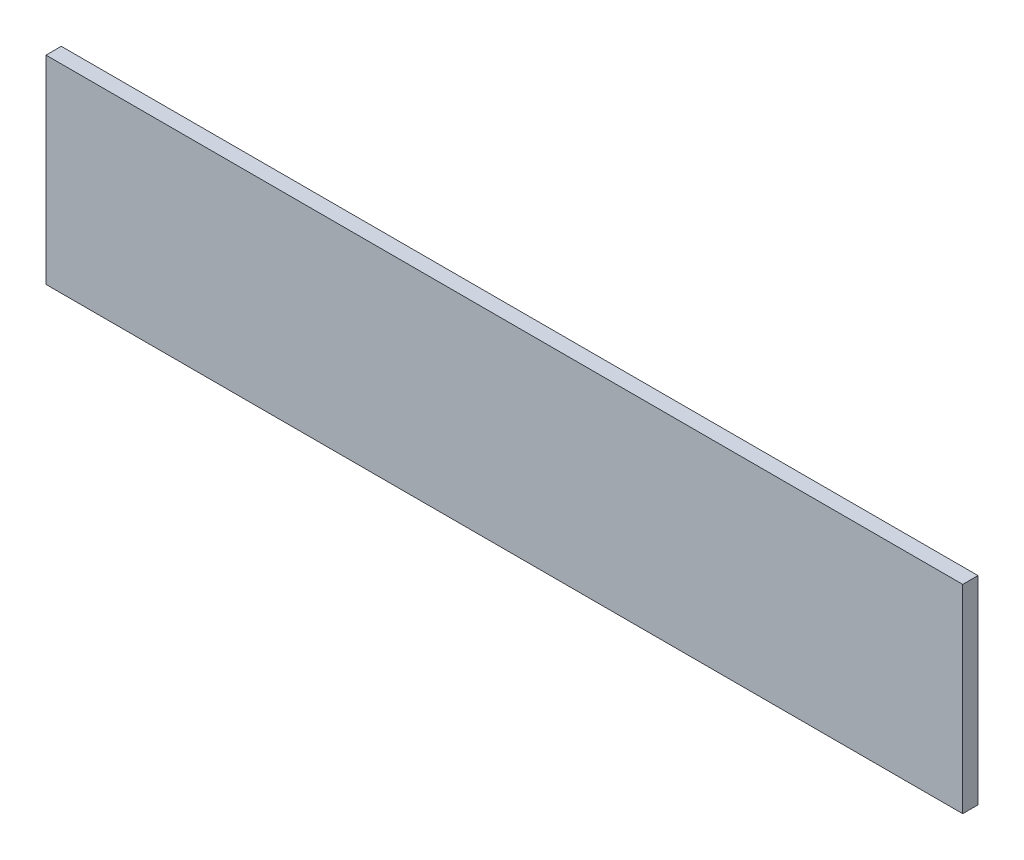
ISO-10303-21;
HEADER;
FILE_DESCRIPTION(('STEP AP214'),'2;1');
FILE_NAME('part.step','',(''),(''),'','','');
FILE_SCHEMA(('AUTOMOTIVE_DESIGN { 1 0 10303 214 1 1 1 1 }'));
ENDSEC;
DATA;
#1=APPLICATION_CONTEXT('core data for automotive mechanical design processes');
#2=APPLICATION_PROTOCOL_DEFINITION('international standard','automotive_design',2000,#1);
#3=PRODUCT_CONTEXT('',#1,'mechanical');
#4=PRODUCT('Part','Part','',(#3));
#5=PRODUCT_RELATED_PRODUCT_CATEGORY('part','',(#4));
#6=PRODUCT_DEFINITION_FORMATION('','',#4);
#7=PRODUCT_DEFINITION_CONTEXT('part definition',#1,'design');
#8=PRODUCT_DEFINITION('design','',#6,#7);
#9=PRODUCT_DEFINITION_SHAPE('','',#8);
#10=(LENGTH_UNIT() NAMED_UNIT(*) SI_UNIT(.MILLI.,.METRE.));
#11=(NAMED_UNIT(*) PLANE_ANGLE_UNIT() SI_UNIT($,.RADIAN.));
#12=(NAMED_UNIT(*) SI_UNIT($,.STERADIAN.) SOLID_ANGLE_UNIT());
#13=UNCERTAINTY_MEASURE_WITH_UNIT(LENGTH_MEASURE(1.E-05),#10,'distance_accuracy_value','');
#14=(GEOMETRIC_REPRESENTATION_CONTEXT(3) GLOBAL_UNCERTAINTY_ASSIGNED_CONTEXT((#13)) GLOBAL_UNIT_ASSIGNED_CONTEXT((#10,
#11,#12)) REPRESENTATION_CONTEXT('',''));
#15=CARTESIAN_POINT('',(0.,0.,0.));
#16=DIRECTION('',(0.,0.,1.));
#17=DIRECTION('',(1.,0.,0.));
#18=AXIS2_PLACEMENT_3D('',#15,#16,#17);
#19=CARTESIAN_POINT('',(0.,0.,10.));
#20=DIRECTION('',(1.,0.,0.));
#21=DIRECTION('',(0.,0.,-1.));
#22=AXIS2_PLACEMENT_3D('',#19,#20,#21);
#23=PLANE('',#22);
#24=DIRECTION('',(0.,-1.,0.));
#25=VECTOR('',#24,1.);
#26=CARTESIAN_POINT('',(0.,0.,0.));
#27=LINE('',#26,#25);
#28=CARTESIAN_POINT('',(0.,130.,0.));
#29=VERTEX_POINT('',#28);
#30=CARTESIAN_POINT('',(0.,0.,0.));
#31=VERTEX_POINT('',#30);
#32=EDGE_CURVE('E96',#29,#31,#27,.T.);
#33=ORIENTED_EDGE('',*,*,#32,.T.);
#34=DIRECTION('',(0.,0.,-1.));
#35=VECTOR('',#34,1.);
#36=CARTESIAN_POINT('',(0.,0.,10.));
#37=LINE('',#36,#35);
#38=CARTESIAN_POINT('',(0.,0.,10.));
#39=VERTEX_POINT('',#38);
#40=EDGE_CURVE('E11',#39,#31,#37,.T.);
#41=ORIENTED_EDGE('',*,*,#40,.F.);
#42=DIRECTION('',(0.,-1.,0.));
#43=VECTOR('',#42,1.);
#44=CARTESIAN_POINT('',(0.,0.,10.));
#45=LINE('',#44,#43);
#46=CARTESIAN_POINT('',(0.,130.,10.));
#47=VERTEX_POINT('',#46);
#48=EDGE_CURVE('E84',#47,#39,#45,.T.);
#49=ORIENTED_EDGE('',*,*,#48,.F.);
#50=DIRECTION('',(0.,0.,-1.));
#51=VECTOR('',#50,1.);
#52=CARTESIAN_POINT('',(0.,130.,10.));
#53=LINE('',#52,#51);
#54=EDGE_CURVE('E92',#47,#29,#53,.T.);
#55=ORIENTED_EDGE('',*,*,#54,.T.);
#56=EDGE_LOOP('',(#33,#41,#49,#55));
#57=FACE_BOUND('',#56,.T.);
#58=ADVANCED_FACE('F33',(#57),#23,.F.);
#59=CARTESIAN_POINT('',(0.,0.,10.));
#60=DIRECTION('',(0.,1.,0.));
#61=DIRECTION('',(0.,0.,1.));
#62=AXIS2_PLACEMENT_3D('',#59,#60,#61);
#63=PLANE('',#62);
#64=DIRECTION('',(1.,0.,0.));
#65=VECTOR('',#64,1.);
#66=CARTESIAN_POINT('',(0.,0.,0.));
#67=LINE('',#66,#65);
#68=CARTESIAN_POINT('',(600.,0.,0.));
#69=VERTEX_POINT('',#68);
#70=EDGE_CURVE('E88',#31,#69,#67,.T.);
#71=ORIENTED_EDGE('',*,*,#70,.T.);
#72=DIRECTION('',(0.,0.,-1.));
#73=VECTOR('',#72,1.);
#74=CARTESIAN_POINT('',(600.,0.,10.));
#75=LINE('',#74,#73);
#76=CARTESIAN_POINT('',(600.,0.,10.));
#77=VERTEX_POINT('',#76);
#78=EDGE_CURVE('E41',#77,#69,#75,.T.);
#79=ORIENTED_EDGE('',*,*,#78,.F.);
#80=DIRECTION('',(1.,0.,0.));
#81=VECTOR('',#80,1.);
#82=CARTESIAN_POINT('',(0.,0.,10.));
#83=LINE('',#82,#81);
#84=EDGE_CURVE('E79',#39,#77,#83,.T.);
#85=ORIENTED_EDGE('',*,*,#84,.F.);
#86=ORIENTED_EDGE('',*,*,#40,.T.);
#87=EDGE_LOOP('',(#71,#79,#85,#86));
#88=FACE_BOUND('',#87,.T.);
#89=ADVANCED_FACE('F87',(#88),#63,.F.);
#90=CARTESIAN_POINT('',(600.,0.,10.));
#91=DIRECTION('',(-1.,0.,0.));
#92=DIRECTION('',(0.,0.,1.));
#93=AXIS2_PLACEMENT_3D('',#90,#91,#92);
#94=PLANE('',#93);
#95=DIRECTION('',(0.,1.,0.));
#96=VECTOR('',#95,1.);
#97=CARTESIAN_POINT('',(600.,0.,0.));
#98=LINE('',#97,#96);
#99=CARTESIAN_POINT('',(600.,130.,0.));
#100=VERTEX_POINT('',#99);
#101=EDGE_CURVE('E66',#69,#100,#98,.T.);
#102=ORIENTED_EDGE('',*,*,#101,.T.);
#103=DIRECTION('',(0.,0.,-1.));
#104=VECTOR('',#103,1.);
#105=CARTESIAN_POINT('',(600.,130.,10.));
#106=LINE('',#105,#104);
#107=CARTESIAN_POINT('',(600.,130.,10.));
#108=VERTEX_POINT('',#107);
#109=EDGE_CURVE('E89',#108,#100,#106,.T.);
#110=ORIENTED_EDGE('',*,*,#109,.F.);
#111=DIRECTION('',(0.,1.,0.));
#112=VECTOR('',#111,1.);
#113=CARTESIAN_POINT('',(600.,0.,10.));
#114=LINE('',#113,#112);
#115=EDGE_CURVE('E82',#77,#108,#114,.T.);
#116=ORIENTED_EDGE('',*,*,#115,.F.);
#117=ORIENTED_EDGE('',*,*,#78,.T.);
#118=EDGE_LOOP('',(#102,#110,#116,#117));
#119=FACE_BOUND('',#118,.T.);
#120=ADVANCED_FACE('F90',(#119),#94,.F.);
#121=CARTESIAN_POINT('',(0.,130.,10.));
#122=DIRECTION('',(0.,-1.,0.));
#123=DIRECTION('',(0.,0.,-1.));
#124=AXIS2_PLACEMENT_3D('',#121,#122,#123);
#125=PLANE('',#124);
#126=DIRECTION('',(-1.,0.,0.));
#127=VECTOR('',#126,1.);
#128=CARTESIAN_POINT('',(0.,130.,0.));
#129=LINE('',#128,#127);
#130=EDGE_CURVE('E72',#100,#29,#129,.T.);
#131=ORIENTED_EDGE('',*,*,#130,.T.);
#132=ORIENTED_EDGE('',*,*,#54,.F.);
#133=DIRECTION('',(-1.,0.,0.));
#134=VECTOR('',#133,1.);
#135=CARTESIAN_POINT('',(0.,130.,10.));
#136=LINE('',#135,#134);
#137=EDGE_CURVE('E49',#108,#47,#136,.T.);
#138=ORIENTED_EDGE('',*,*,#137,.F.);
#139=ORIENTED_EDGE('',*,*,#109,.T.);
#140=EDGE_LOOP('',(#131,#132,#138,#139));
#141=FACE_BOUND('',#140,.T.);
#142=ADVANCED_FACE('F103',(#141),#125,.F.);
#143=CARTESIAN_POINT('',(0.,0.,10.));
#144=DIRECTION('',(0.,0.,-1.));
#145=DIRECTION('',(-1.,0.,0.));
#146=AXIS2_PLACEMENT_3D('',#143,#144,#145);
#147=PLANE('',#146);
#148=ORIENTED_EDGE('',*,*,#48,.T.);
#149=ORIENTED_EDGE('',*,*,#84,.T.);
#150=ORIENTED_EDGE('',*,*,#115,.T.);
#151=ORIENTED_EDGE('',*,*,#137,.T.);
#152=EDGE_LOOP('',(#148,#149,#150,#151));
#153=FACE_BOUND('',#152,.T.);
#154=ADVANCED_FACE('F80',(#153),#147,.F.);
#155=CARTESIAN_POINT('',(0.,0.,0.));
#156=DIRECTION('',(0.,0.,-1.));
#157=DIRECTION('',(-1.,0.,0.));
#158=AXIS2_PLACEMENT_3D('',#155,#156,#157);
#159=PLANE('',#158);
#160=ORIENTED_EDGE('',*,*,#32,.F.);
#161=ORIENTED_EDGE('',*,*,#130,.F.);
#162=ORIENTED_EDGE('',*,*,#101,.F.);
#163=ORIENTED_EDGE('',*,*,#70,.F.);
#164=EDGE_LOOP('',(#160,#161,#162,#163));
#165=FACE_BOUND('',#164,.T.);
#166=ADVANCED_FACE('F106',(#165),#159,.T.);
#167=CLOSED_SHELL('',(#58,#89,#120,#142,#154,#166));
#168=MANIFOLD_SOLID_BREP('B2',#167);
#169=ADVANCED_BREP_SHAPE_REPRESENTATION('',(#18,#168),#14);
#170=SHAPE_DEFINITION_REPRESENTATION(#9,#169);
ENDSEC;
END-ISO-10303-21;
